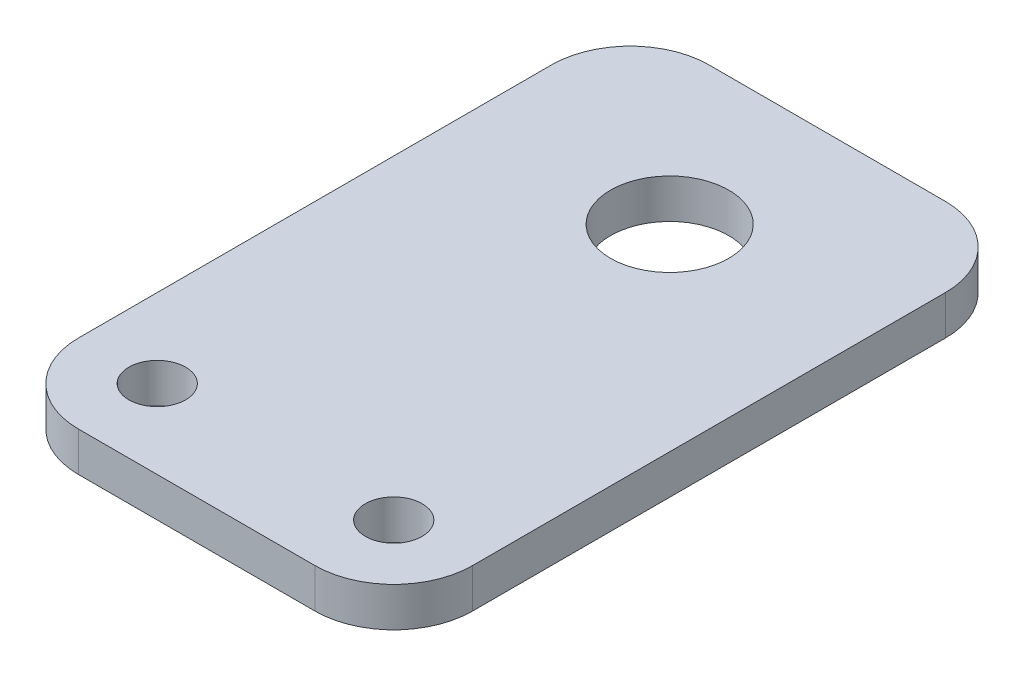
ISO-10303-21;
HEADER;
FILE_DESCRIPTION(('STEP AP214'),'2;1');
FILE_NAME('part.step','',(''),(''),'','','');
FILE_SCHEMA(('AUTOMOTIVE_DESIGN { 1 0 10303 214 1 1 1 1 }'));
ENDSEC;
DATA;
#1=APPLICATION_CONTEXT('core data for automotive mechanical design processes');
#2=APPLICATION_PROTOCOL_DEFINITION('international standard','automotive_design',2000,#1);
#3=PRODUCT_CONTEXT('',#1,'mechanical');
#4=PRODUCT('Part','Part','',(#3));
#5=PRODUCT_RELATED_PRODUCT_CATEGORY('part','',(#4));
#6=PRODUCT_DEFINITION_FORMATION('','',#4);
#7=PRODUCT_DEFINITION_CONTEXT('part definition',#1,'design');
#8=PRODUCT_DEFINITION('design','',#6,#7);
#9=PRODUCT_DEFINITION_SHAPE('','',#8);
#10=(LENGTH_UNIT() NAMED_UNIT(*) SI_UNIT(.MILLI.,.METRE.));
#11=(NAMED_UNIT(*) PLANE_ANGLE_UNIT() SI_UNIT($,.RADIAN.));
#12=(NAMED_UNIT(*) SI_UNIT($,.STERADIAN.) SOLID_ANGLE_UNIT());
#13=UNCERTAINTY_MEASURE_WITH_UNIT(LENGTH_MEASURE(1.E-05),#10,'distance_accuracy_value','');
#14=(GEOMETRIC_REPRESENTATION_CONTEXT(3) GLOBAL_UNCERTAINTY_ASSIGNED_CONTEXT((#13)) GLOBAL_UNIT_ASSIGNED_CONTEXT((#10,
#11,#12)) REPRESENTATION_CONTEXT('',''));
#15=CARTESIAN_POINT('',(0.,0.,0.));
#16=DIRECTION('',(0.,0.,1.));
#17=DIRECTION('',(1.,0.,0.));
#18=AXIS2_PLACEMENT_3D('',#15,#16,#17);
#19=CARTESIAN_POINT('',(0.,3.175,0.));
#20=DIRECTION('',(0.,-1.,0.));
#21=DIRECTION('',(0.,0.,-1.));
#22=AXIS2_PLACEMENT_3D('',#19,#20,#21);
#23=PLANE('',#22);
#24=DIRECTION('',(1.,0.,0.));
#25=VECTOR('',#24,1.);
#26=CARTESIAN_POINT('',(0.,3.175,0.));
#27=LINE('',#26,#25);
#28=CARTESIAN_POINT('',(6.35,3.175,0.));
#29=VERTEX_POINT('',#28);
#30=CARTESIAN_POINT('',(25.4,3.175,0.));
#31=VERTEX_POINT('',#30);
#32=EDGE_CURVE('E194',#29,#31,#27,.T.);
#33=ORIENTED_EDGE('',*,*,#32,.T.);
#34=CARTESIAN_POINT('',(25.4,3.175,-6.35));
#35=DIRECTION('',(0.,-1.,0.));
#36=DIRECTION('',(0.,0.,-1.));
#37=AXIS2_PLACEMENT_3D('',#34,#35,#36);
#38=CIRCLE('',#37,6.35);
#39=CARTESIAN_POINT('',(31.75,3.175,-6.35));
#40=VERTEX_POINT('',#39);
#41=EDGE_CURVE('E170',#31,#40,#38,.F.);
#42=ORIENTED_EDGE('',*,*,#41,.T.);
#43=DIRECTION('',(0.,0.,-1.));
#44=VECTOR('',#43,1.);
#45=CARTESIAN_POINT('',(31.75,3.175,0.));
#46=LINE('',#45,#44);
#47=CARTESIAN_POINT('',(31.75,3.175,-44.45));
#48=VERTEX_POINT('',#47);
#49=EDGE_CURVE('E127',#40,#48,#46,.T.);
#50=ORIENTED_EDGE('',*,*,#49,.T.);
#51=CARTESIAN_POINT('',(25.4,3.175,-44.45));
#52=DIRECTION('',(0.,-1.,0.));
#53=DIRECTION('',(0.,0.,-1.));
#54=AXIS2_PLACEMENT_3D('',#51,#52,#53);
#55=CIRCLE('',#54,6.35);
#56=CARTESIAN_POINT('',(25.4,3.175,-50.8));
#57=VERTEX_POINT('',#56);
#58=EDGE_CURVE('E62',#48,#57,#55,.F.);
#59=ORIENTED_EDGE('',*,*,#58,.T.);
#60=DIRECTION('',(-1.,0.,0.));
#61=VECTOR('',#60,1.);
#62=CARTESIAN_POINT('',(0.,3.175,-50.8));
#63=LINE('',#62,#61);
#64=CARTESIAN_POINT('',(6.35,3.175,-50.8));
#65=VERTEX_POINT('',#64);
#66=EDGE_CURVE('E148',#57,#65,#63,.T.);
#67=ORIENTED_EDGE('',*,*,#66,.T.);
#68=CARTESIAN_POINT('',(6.35,3.175,-44.45));
#69=DIRECTION('',(0.,-1.,0.));
#70=DIRECTION('',(0.,0.,-1.));
#71=AXIS2_PLACEMENT_3D('',#68,#69,#70);
#72=CIRCLE('',#71,6.35);
#73=CARTESIAN_POINT('',(0.,3.175,-44.45));
#74=VERTEX_POINT('',#73);
#75=EDGE_CURVE('E165',#65,#74,#72,.F.);
#76=ORIENTED_EDGE('',*,*,#75,.T.);
#77=DIRECTION('',(0.,0.,1.));
#78=VECTOR('',#77,1.);
#79=CARTESIAN_POINT('',(0.,3.175,0.));
#80=LINE('',#79,#78);
#81=CARTESIAN_POINT('',(0.,3.175,-6.35));
#82=VERTEX_POINT('',#81);
#83=EDGE_CURVE('E141',#74,#82,#80,.T.);
#84=ORIENTED_EDGE('',*,*,#83,.T.);
#85=CARTESIAN_POINT('',(6.35,3.175,-6.35));
#86=DIRECTION('',(0.,-1.,0.));
#87=DIRECTION('',(0.,0.,-1.));
#88=AXIS2_PLACEMENT_3D('',#85,#86,#87);
#89=CIRCLE('',#88,6.35);
#90=EDGE_CURVE('E162',#82,#29,#89,.F.);
#91=ORIENTED_EDGE('',*,*,#90,.T.);
#92=EDGE_LOOP('',(#33,#42,#50,#59,#67,#76,#84,#91));
#93=FACE_BOUND('',#92,.T.);
#94=CARTESIAN_POINT('',(15.875,3.175,-38.1));
#95=DIRECTION('',(0.,1.,0.));
#96=DIRECTION('',(0.,0.,1.));
#97=AXIS2_PLACEMENT_3D('',#94,#95,#96);
#98=CIRCLE('',#97,4.7625);
#99=CARTESIAN_POINT('',(15.875,3.175,-33.3375));
#100=VERTEX_POINT('',#99);
#101=EDGE_CURVE('E200',#100,#100,#98,.T.);
#102=ORIENTED_EDGE('',*,*,#101,.F.);
#103=EDGE_LOOP('',(#102));
#104=FACE_BOUND('',#103,.T.);
#105=CARTESIAN_POINT('',(6.35,3.175,-6.35));
#106=DIRECTION('',(0.,1.,0.));
#107=DIRECTION('',(0.,0.,1.));
#108=AXIS2_PLACEMENT_3D('',#105,#106,#107);
#109=CIRCLE('',#108,2.286);
#110=CARTESIAN_POINT('',(6.35,3.175,-4.064));
#111=VERTEX_POINT('',#110);
#112=EDGE_CURVE('E214',#111,#111,#109,.T.);
#113=ORIENTED_EDGE('',*,*,#112,.F.);
#114=EDGE_LOOP('',(#113));
#115=FACE_BOUND('',#114,.T.);
#116=CARTESIAN_POINT('',(25.4,3.175,-6.35));
#117=DIRECTION('',(0.,1.,0.));
#118=DIRECTION('',(0.,0.,1.));
#119=AXIS2_PLACEMENT_3D('',#116,#117,#118);
#120=CIRCLE('',#119,2.286);
#121=CARTESIAN_POINT('',(25.4,3.175,-4.064));
#122=VERTEX_POINT('',#121);
#123=EDGE_CURVE('E220',#122,#122,#120,.T.);
#124=ORIENTED_EDGE('',*,*,#123,.F.);
#125=EDGE_LOOP('',(#124));
#126=FACE_BOUND('',#125,.T.);
#127=ADVANCED_FACE('F39',(#93,#104,#115,#126),#23,.F.);
#128=CARTESIAN_POINT('',(0.,0.,0.));
#129=DIRECTION('',(0.,-1.,0.));
#130=DIRECTION('',(0.,0.,-1.));
#131=AXIS2_PLACEMENT_3D('',#128,#129,#130);
#132=PLANE('',#131);
#133=CARTESIAN_POINT('',(6.35,0.,-6.35));
#134=DIRECTION('',(0.,1.,0.));
#135=DIRECTION('',(0.,0.,1.));
#136=AXIS2_PLACEMENT_3D('',#133,#134,#135);
#137=CIRCLE('',#136,2.286);
#138=CARTESIAN_POINT('',(6.35,0.,-4.064));
#139=VERTEX_POINT('',#138);
#140=EDGE_CURVE('E216',#139,#139,#137,.T.);
#141=ORIENTED_EDGE('',*,*,#140,.T.);
#142=EDGE_LOOP('',(#141));
#143=FACE_BOUND('',#142,.T.);
#144=DIRECTION('',(0.,0.,-1.));
#145=VECTOR('',#144,1.);
#146=CARTESIAN_POINT('',(31.75,0.,0.));
#147=LINE('',#146,#145);
#148=CARTESIAN_POINT('',(31.75,0.,-6.35));
#149=VERTEX_POINT('',#148);
#150=CARTESIAN_POINT('',(31.75,0.,-44.45));
#151=VERTEX_POINT('',#150);
#152=EDGE_CURVE('E125',#149,#151,#147,.T.);
#153=ORIENTED_EDGE('',*,*,#152,.F.);
#154=CARTESIAN_POINT('',(25.4,0.,-6.35));
#155=DIRECTION('',(0.,-1.,0.));
#156=DIRECTION('',(0.,0.,-1.));
#157=AXIS2_PLACEMENT_3D('',#154,#155,#156);
#158=CIRCLE('',#157,6.35);
#159=CARTESIAN_POINT('',(25.4,0.,0.));
#160=VERTEX_POINT('',#159);
#161=EDGE_CURVE('E107',#149,#160,#158,.T.);
#162=ORIENTED_EDGE('',*,*,#161,.T.);
#163=DIRECTION('',(1.,0.,0.));
#164=VECTOR('',#163,1.);
#165=CARTESIAN_POINT('',(0.,0.,0.));
#166=LINE('',#165,#164);
#167=CARTESIAN_POINT('',(6.35,0.,0.));
#168=VERTEX_POINT('',#167);
#169=EDGE_CURVE('E137',#168,#160,#166,.T.);
#170=ORIENTED_EDGE('',*,*,#169,.F.);
#171=CARTESIAN_POINT('',(6.35,0.,-6.35));
#172=DIRECTION('',(0.,-1.,0.));
#173=DIRECTION('',(0.,0.,-1.));
#174=AXIS2_PLACEMENT_3D('',#171,#172,#173);
#175=CIRCLE('',#174,6.35);
#176=CARTESIAN_POINT('',(0.,0.,-6.35));
#177=VERTEX_POINT('',#176);
#178=EDGE_CURVE('E129',#168,#177,#175,.T.);
#179=ORIENTED_EDGE('',*,*,#178,.T.);
#180=DIRECTION('',(0.,0.,1.));
#181=VECTOR('',#180,1.);
#182=CARTESIAN_POINT('',(0.,0.,0.));
#183=LINE('',#182,#181);
#184=CARTESIAN_POINT('',(0.,0.,-44.45));
#185=VERTEX_POINT('',#184);
#186=EDGE_CURVE('E143',#185,#177,#183,.T.);
#187=ORIENTED_EDGE('',*,*,#186,.F.);
#188=CARTESIAN_POINT('',(6.35,0.,-44.45));
#189=DIRECTION('',(0.,-1.,0.));
#190=DIRECTION('',(0.,0.,-1.));
#191=AXIS2_PLACEMENT_3D('',#188,#189,#190);
#192=CIRCLE('',#191,6.35);
#193=CARTESIAN_POINT('',(6.35,0.,-50.8));
#194=VERTEX_POINT('',#193);
#195=EDGE_CURVE('E152',#185,#194,#192,.T.);
#196=ORIENTED_EDGE('',*,*,#195,.T.);
#197=DIRECTION('',(-1.,0.,0.));
#198=VECTOR('',#197,1.);
#199=CARTESIAN_POINT('',(0.,0.,-50.8));
#200=LINE('',#199,#198);
#201=CARTESIAN_POINT('',(25.4,0.,-50.8));
#202=VERTEX_POINT('',#201);
#203=EDGE_CURVE('E136',#202,#194,#200,.T.);
#204=ORIENTED_EDGE('',*,*,#203,.F.);
#205=CARTESIAN_POINT('',(25.4,0.,-44.45));
#206=DIRECTION('',(0.,-1.,0.));
#207=DIRECTION('',(0.,0.,-1.));
#208=AXIS2_PLACEMENT_3D('',#205,#206,#207);
#209=CIRCLE('',#208,6.35);
#210=EDGE_CURVE('E119',#202,#151,#209,.T.);
#211=ORIENTED_EDGE('',*,*,#210,.T.);
#212=EDGE_LOOP('',(#153,#162,#170,#179,#187,#196,#204,#211));
#213=FACE_BOUND('',#212,.T.);
#214=CARTESIAN_POINT('',(15.875,0.,-38.1));
#215=DIRECTION('',(0.,1.,0.));
#216=DIRECTION('',(0.,0.,1.));
#217=AXIS2_PLACEMENT_3D('',#214,#215,#216);
#218=CIRCLE('',#217,4.7625);
#219=CARTESIAN_POINT('',(15.875,0.,-33.3375));
#220=VERTEX_POINT('',#219);
#221=EDGE_CURVE('E203',#220,#220,#218,.T.);
#222=ORIENTED_EDGE('',*,*,#221,.T.);
#223=EDGE_LOOP('',(#222));
#224=FACE_BOUND('',#223,.T.);
#225=CARTESIAN_POINT('',(25.4,0.,-6.35));
#226=DIRECTION('',(0.,1.,0.));
#227=DIRECTION('',(0.,0.,1.));
#228=AXIS2_PLACEMENT_3D('',#225,#226,#227);
#229=CIRCLE('',#228,2.286);
#230=CARTESIAN_POINT('',(25.4,0.,-4.064));
#231=VERTEX_POINT('',#230);
#232=EDGE_CURVE('E224',#231,#231,#229,.T.);
#233=ORIENTED_EDGE('',*,*,#232,.T.);
#234=EDGE_LOOP('',(#233));
#235=FACE_BOUND('',#234,.T.);
#236=ADVANCED_FACE('F132',(#143,#213,#224,#235),#132,.T.);
#237=CARTESIAN_POINT('',(0.,3.175,0.));
#238=DIRECTION('',(1.,0.,0.));
#239=DIRECTION('',(0.,0.,-1.));
#240=AXIS2_PLACEMENT_3D('',#237,#238,#239);
#241=PLANE('',#240);
#242=ORIENTED_EDGE('',*,*,#83,.F.);
#243=DIRECTION('',(0.,-1.,0.));
#244=VECTOR('',#243,1.);
#245=CARTESIAN_POINT('',(0.,3.175,-44.45));
#246=LINE('',#245,#244);
#247=EDGE_CURVE('E11',#74,#185,#246,.T.);
#248=ORIENTED_EDGE('',*,*,#247,.T.);
#249=ORIENTED_EDGE('',*,*,#186,.T.);
#250=DIRECTION('',(0.,-1.,0.));
#251=VECTOR('',#250,1.);
#252=CARTESIAN_POINT('',(0.,3.175,-6.35));
#253=LINE('',#252,#251);
#254=EDGE_CURVE('E48',#177,#82,#253,.F.);
#255=ORIENTED_EDGE('',*,*,#254,.T.);
#256=EDGE_LOOP('',(#242,#248,#249,#255));
#257=FACE_BOUND('',#256,.T.);
#258=ADVANCED_FACE('F184',(#257),#241,.F.);
#259=CARTESIAN_POINT('',(0.,3.175,0.));
#260=DIRECTION('',(0.,0.,-1.));
#261=DIRECTION('',(-1.,0.,0.));
#262=AXIS2_PLACEMENT_3D('',#259,#260,#261);
#263=PLANE('',#262);
#264=ORIENTED_EDGE('',*,*,#169,.T.);
#265=DIRECTION('',(0.,-1.,0.));
#266=VECTOR('',#265,1.);
#267=CARTESIAN_POINT('',(25.4,3.175,0.));
#268=LINE('',#267,#266);
#269=EDGE_CURVE('E112',#160,#31,#268,.F.);
#270=ORIENTED_EDGE('',*,*,#269,.T.);
#271=ORIENTED_EDGE('',*,*,#32,.F.);
#272=DIRECTION('',(0.,-1.,0.));
#273=VECTOR('',#272,1.);
#274=CARTESIAN_POINT('',(6.35,3.175,0.));
#275=LINE('',#274,#273);
#276=EDGE_CURVE('E118',#29,#168,#275,.T.);
#277=ORIENTED_EDGE('',*,*,#276,.T.);
#278=EDGE_LOOP('',(#264,#270,#271,#277));
#279=FACE_BOUND('',#278,.T.);
#280=ADVANCED_FACE('F198',(#279),#263,.F.);
#281=CARTESIAN_POINT('',(31.75,3.175,0.));
#282=DIRECTION('',(-1.,0.,0.));
#283=DIRECTION('',(0.,0.,1.));
#284=AXIS2_PLACEMENT_3D('',#281,#282,#283);
#285=PLANE('',#284);
#286=ORIENTED_EDGE('',*,*,#49,.F.);
#287=DIRECTION('',(0.,-1.,0.));
#288=VECTOR('',#287,1.);
#289=CARTESIAN_POINT('',(31.75,3.175,-6.35));
#290=LINE('',#289,#288);
#291=EDGE_CURVE('E111',#40,#149,#290,.T.);
#292=ORIENTED_EDGE('',*,*,#291,.T.);
#293=ORIENTED_EDGE('',*,*,#152,.T.);
#294=DIRECTION('',(0.,-1.,0.));
#295=VECTOR('',#294,1.);
#296=CARTESIAN_POINT('',(31.75,3.175,-44.45));
#297=LINE('',#296,#295);
#298=EDGE_CURVE('E130',#151,#48,#297,.F.);
#299=ORIENTED_EDGE('',*,*,#298,.T.);
#300=EDGE_LOOP('',(#286,#292,#293,#299));
#301=FACE_BOUND('',#300,.T.);
#302=ADVANCED_FACE('F124',(#301),#285,.F.);
#303=CARTESIAN_POINT('',(0.,3.175,-50.8));
#304=DIRECTION('',(0.,0.,1.));
#305=DIRECTION('',(1.,0.,0.));
#306=AXIS2_PLACEMENT_3D('',#303,#304,#305);
#307=PLANE('',#306);
#308=ORIENTED_EDGE('',*,*,#66,.F.);
#309=DIRECTION('',(0.,-1.,0.));
#310=VECTOR('',#309,1.);
#311=CARTESIAN_POINT('',(25.4,3.175,-50.8));
#312=LINE('',#311,#310);
#313=EDGE_CURVE('E175',#57,#202,#312,.T.);
#314=ORIENTED_EDGE('',*,*,#313,.T.);
#315=ORIENTED_EDGE('',*,*,#203,.T.);
#316=DIRECTION('',(0.,-1.,0.));
#317=VECTOR('',#316,1.);
#318=CARTESIAN_POINT('',(6.35,3.175,-50.8));
#319=LINE('',#318,#317);
#320=EDGE_CURVE('E55',#194,#65,#319,.F.);
#321=ORIENTED_EDGE('',*,*,#320,.T.);
#322=EDGE_LOOP('',(#308,#314,#315,#321));
#323=FACE_BOUND('',#322,.T.);
#324=ADVANCED_FACE('F246',(#323),#307,.F.);
#325=CARTESIAN_POINT('',(15.875,3.175,-38.1));
#326=DIRECTION('',(0.,-1.,0.));
#327=DIRECTION('',(0.,0.,-1.));
#328=AXIS2_PLACEMENT_3D('',#325,#326,#327);
#329=CYLINDRICAL_SURFACE('',#328,4.7625);
#330=ORIENTED_EDGE('',*,*,#101,.T.);
#331=EDGE_LOOP('',(#330));
#332=FACE_BOUND('',#331,.T.);
#333=ORIENTED_EDGE('',*,*,#221,.F.);
#334=EDGE_LOOP('',(#333));
#335=FACE_BOUND('',#334,.T.);
#336=ADVANCED_FACE('F243',(#332,#335),#329,.F.);
#337=CARTESIAN_POINT('',(6.35,3.175,-6.35));
#338=DIRECTION('',(0.,-1.,0.));
#339=DIRECTION('',(0.,0.,-1.));
#340=AXIS2_PLACEMENT_3D('',#337,#338,#339);
#341=CYLINDRICAL_SURFACE('',#340,2.286);
#342=ORIENTED_EDGE('',*,*,#112,.T.);
#343=EDGE_LOOP('',(#342));
#344=FACE_BOUND('',#343,.T.);
#345=ORIENTED_EDGE('',*,*,#140,.F.);
#346=EDGE_LOOP('',(#345));
#347=FACE_BOUND('',#346,.T.);
#348=ADVANCED_FACE('F329',(#344,#347),#341,.F.);
#349=CARTESIAN_POINT('',(25.4,3.175,-6.35));
#350=DIRECTION('',(0.,-1.,0.));
#351=DIRECTION('',(0.,0.,-1.));
#352=AXIS2_PLACEMENT_3D('',#349,#350,#351);
#353=CYLINDRICAL_SURFACE('',#352,2.286);
#354=ORIENTED_EDGE('',*,*,#123,.T.);
#355=EDGE_LOOP('',(#354));
#356=FACE_BOUND('',#355,.T.);
#357=ORIENTED_EDGE('',*,*,#232,.F.);
#358=EDGE_LOOP('',(#357));
#359=FACE_BOUND('',#358,.T.);
#360=ADVANCED_FACE('F232',(#356,#359),#353,.F.);
#361=CARTESIAN_POINT('',(25.4,3.175,-6.35));
#362=DIRECTION('',(0.,-1.,0.));
#363=DIRECTION('',(0.,0.,-1.));
#364=AXIS2_PLACEMENT_3D('',#361,#362,#363);
#365=CYLINDRICAL_SURFACE('',#364,6.35);
#366=ORIENTED_EDGE('',*,*,#41,.F.);
#367=ORIENTED_EDGE('',*,*,#269,.F.);
#368=ORIENTED_EDGE('',*,*,#161,.F.);
#369=ORIENTED_EDGE('',*,*,#291,.F.);
#370=EDGE_LOOP('',(#366,#367,#368,#369));
#371=FACE_BOUND('',#370,.T.);
#372=ADVANCED_FACE('F110',(#371),#365,.T.);
#373=CARTESIAN_POINT('',(25.4,3.175,-44.45));
#374=DIRECTION('',(0.,-1.,0.));
#375=DIRECTION('',(0.,0.,-1.));
#376=AXIS2_PLACEMENT_3D('',#373,#374,#375);
#377=CYLINDRICAL_SURFACE('',#376,6.35);
#378=ORIENTED_EDGE('',*,*,#58,.F.);
#379=ORIENTED_EDGE('',*,*,#298,.F.);
#380=ORIENTED_EDGE('',*,*,#210,.F.);
#381=ORIENTED_EDGE('',*,*,#313,.F.);
#382=EDGE_LOOP('',(#378,#379,#380,#381));
#383=FACE_BOUND('',#382,.T.);
#384=ADVANCED_FACE('F257',(#383),#377,.T.);
#385=CARTESIAN_POINT('',(6.35,3.175,-44.45));
#386=DIRECTION('',(0.,-1.,0.));
#387=DIRECTION('',(0.,0.,-1.));
#388=AXIS2_PLACEMENT_3D('',#385,#386,#387);
#389=CYLINDRICAL_SURFACE('',#388,6.35);
#390=ORIENTED_EDGE('',*,*,#75,.F.);
#391=ORIENTED_EDGE('',*,*,#320,.F.);
#392=ORIENTED_EDGE('',*,*,#195,.F.);
#393=ORIENTED_EDGE('',*,*,#247,.F.);
#394=EDGE_LOOP('',(#390,#391,#392,#393));
#395=FACE_BOUND('',#394,.T.);
#396=ADVANCED_FACE('F259',(#395),#389,.T.);
#397=CARTESIAN_POINT('',(6.35,3.175,-6.35));
#398=DIRECTION('',(0.,-1.,0.));
#399=DIRECTION('',(0.,0.,-1.));
#400=AXIS2_PLACEMENT_3D('',#397,#398,#399);
#401=CYLINDRICAL_SURFACE('',#400,6.35);
#402=ORIENTED_EDGE('',*,*,#90,.F.);
#403=ORIENTED_EDGE('',*,*,#254,.F.);
#404=ORIENTED_EDGE('',*,*,#178,.F.);
#405=ORIENTED_EDGE('',*,*,#276,.F.);
#406=EDGE_LOOP('',(#402,#403,#404,#405));
#407=FACE_BOUND('',#406,.T.);
#408=ADVANCED_FACE('F41',(#407),#401,.T.);
#409=CLOSED_SHELL('',(#127,#236,#258,#280,#302,#324,#336,#348,#360,#372,#384,#396,#408));
#410=MANIFOLD_SOLID_BREP('B2',#409);
#411=ADVANCED_BREP_SHAPE_REPRESENTATION('',(#18,#410),#14);
#412=SHAPE_DEFINITION_REPRESENTATION(#9,#411);
ENDSEC;
END-ISO-10303-21;
